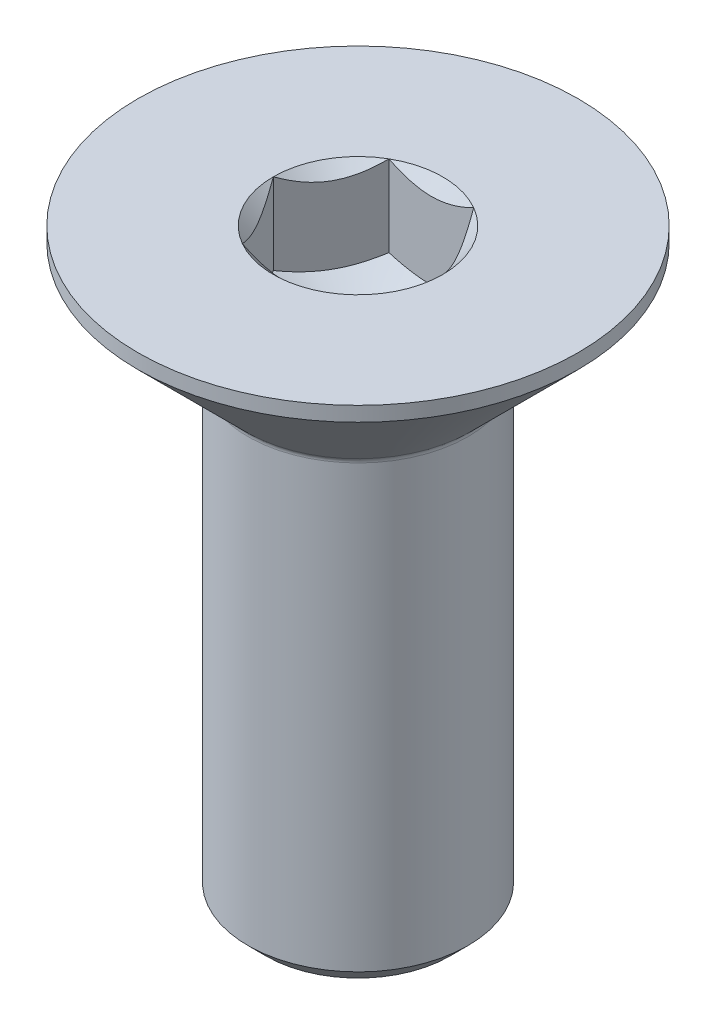
ISO-10303-21;
HEADER;
FILE_DESCRIPTION(('STEP AP214'),'2;1');
FILE_NAME('part.step','',(''),(''),'','','');
FILE_SCHEMA(('AUTOMOTIVE_DESIGN { 1 0 10303 214 1 1 1 1 }'));
ENDSEC;
DATA;
#1=APPLICATION_CONTEXT('core data for automotive mechanical design processes');
#2=APPLICATION_PROTOCOL_DEFINITION('international standard','automotive_design',2000,#1);
#3=PRODUCT_CONTEXT('',#1,'mechanical');
#4=PRODUCT('Part','Part','',(#3));
#5=PRODUCT_RELATED_PRODUCT_CATEGORY('part','',(#4));
#6=PRODUCT_DEFINITION_FORMATION('','',#4);
#7=PRODUCT_DEFINITION_CONTEXT('part definition',#1,'design');
#8=PRODUCT_DEFINITION('design','',#6,#7);
#9=PRODUCT_DEFINITION_SHAPE('','',#8);
#10=(LENGTH_UNIT() NAMED_UNIT(*) SI_UNIT(.MILLI.,.METRE.));
#11=(NAMED_UNIT(*) PLANE_ANGLE_UNIT() SI_UNIT($,.RADIAN.));
#12=(NAMED_UNIT(*) SI_UNIT($,.STERADIAN.) SOLID_ANGLE_UNIT());
#13=UNCERTAINTY_MEASURE_WITH_UNIT(LENGTH_MEASURE(1.E-05),#10,'distance_accuracy_value','');
#14=(GEOMETRIC_REPRESENTATION_CONTEXT(3) GLOBAL_UNCERTAINTY_ASSIGNED_CONTEXT((#13)) GLOBAL_UNIT_ASSIGNED_CONTEXT((#10,
#11,#12)) REPRESENTATION_CONTEXT('',''));
#15=CARTESIAN_POINT('',(0.,0.,0.));
#16=DIRECTION('',(0.,0.,1.));
#17=DIRECTION('',(1.,0.,0.));
#18=AXIS2_PLACEMENT_3D('',#15,#16,#17);
#19=CARTESIAN_POINT('',(1.2500000000036,-8.,0.));
#20=DIRECTION('',(0.,-1.,0.));
#21=DIRECTION('',(1.,0.,0.));
#22=AXIS2_PLACEMENT_3D('',#19,#20,#21);
#23=PLANE('',#22);
#24=CARTESIAN_POINT('',(0.,-8.00000000000001,0.));
#25=DIRECTION('',(0.,-1.,0.));
#26=DIRECTION('',(1.,0.,0.));
#27=AXIS2_PLACEMENT_3D('',#24,#25,#26);
#28=CIRCLE('',#27,1.25000000000357);
#29=CARTESIAN_POINT('',(1.2500000000036,-8.,0.));
#30=VERTEX_POINT('',#29);
#31=EDGE_CURVE('E46',#30,#30,#28,.T.);
#32=ORIENTED_EDGE('',*,*,#31,.T.);
#33=EDGE_LOOP('',(#32));
#34=FACE_BOUND('',#33,.T.);
#35=ADVANCED_FACE('F33',(#34),#23,.T.);
#36=CARTESIAN_POINT('',(0.,-8.00000000000001,0.));
#37=DIRECTION('',(0.,1.,0.));
#38=DIRECTION('',(-1.,0.,0.));
#39=AXIS2_PLACEMENT_3D('',#36,#37,#38);
#40=CONICAL_SURFACE('',#39,1.25000000000357,0.785398163397283);
#41=CARTESIAN_POINT('',(0.,-7.74999999999992,0.));
#42=DIRECTION('',(0.,-1.,0.));
#43=DIRECTION('',(1.,0.,0.));
#44=AXIS2_PLACEMENT_3D('',#41,#42,#43);
#45=CIRCLE('',#44,1.50000000000357);
#46=CARTESIAN_POINT('',(1.5000000000036,-7.74999999999992,0.));
#47=VERTEX_POINT('',#46);
#48=EDGE_CURVE('E236',#47,#47,#45,.T.);
#49=ORIENTED_EDGE('',*,*,#48,.T.);
#50=EDGE_LOOP('',(#49));
#51=FACE_BOUND('',#50,.T.);
#52=ORIENTED_EDGE('',*,*,#31,.F.);
#53=EDGE_LOOP('',(#52));
#54=FACE_BOUND('',#53,.T.);
#55=ADVANCED_FACE('F242',(#51,#54),#40,.T.);
#56=CARTESIAN_POINT('',(3.49148133884313E-12,-1000.,0.));
#57=DIRECTION('',(0.,-1.,0.));
#58=DIRECTION('',(1.,0.,0.));
#59=AXIS2_PLACEMENT_3D('',#56,#57,#58);
#60=CYLINDRICAL_SURFACE('',#59,1.50000000000356);
#61=CARTESIAN_POINT('',(0.,-1.74142135623734,0.));
#62=DIRECTION('',(0.,-1.,0.));
#63=DIRECTION('',(1.,0.,0.));
#64=AXIS2_PLACEMENT_3D('',#61,#62,#63);
#65=CIRCLE('',#64,1.50000000000354);
#66=CARTESIAN_POINT('',(1.50000000000354,-1.74142135623733,0.));
#67=VERTEX_POINT('',#66);
#68=EDGE_CURVE('E233',#67,#67,#65,.T.);
#69=ORIENTED_EDGE('',*,*,#68,.T.);
#70=EDGE_LOOP('',(#69));
#71=FACE_BOUND('',#70,.T.);
#72=ORIENTED_EDGE('',*,*,#48,.F.);
#73=EDGE_LOOP('',(#72));
#74=FACE_BOUND('',#73,.T.);
#75=ADVANCED_FACE('F244',(#71,#74),#60,.T.);
#76=CARTESIAN_POINT('',(0.,-1.74142135623745,0.));
#77=DIRECTION('',(0.,-1.,0.));
#78=DIRECTION('',(1.,0.,0.));
#79=AXIS2_PLACEMENT_3D('',#76,#77,#78);
#80=TOROIDAL_SURFACE('',#79,1.60000000000348,0.0999999999999455);
#81=CARTESIAN_POINT('',(0.,-1.67071067811864,0.));
#82=DIRECTION('',(0.,-1.,0.));
#83=DIRECTION('',(1.,0.,0.));
#84=AXIS2_PLACEMENT_3D('',#81,#82,#83);
#85=CIRCLE('',#84,1.52928932188494);
#86=CARTESIAN_POINT('',(1.52928932188494,-1.67071067811863,0.));
#87=VERTEX_POINT('',#86);
#88=EDGE_CURVE('E230',#87,#87,#85,.T.);
#89=ORIENTED_EDGE('',*,*,#88,.T.);
#90=EDGE_LOOP('',(#89));
#91=FACE_BOUND('',#90,.T.);
#92=ORIENTED_EDGE('',*,*,#68,.F.);
#93=EDGE_LOOP('',(#92));
#94=FACE_BOUND('',#93,.T.);
#95=ADVANCED_FACE('F250',(#91,#94),#80,.F.);
#96=CARTESIAN_POINT('',(0.,-1.67071067811864,0.));
#97=DIRECTION('',(0.,1.,0.));
#98=DIRECTION('',(-1.,0.,0.));
#99=AXIS2_PLACEMENT_3D('',#96,#97,#98);
#100=CONICAL_SURFACE('',#99,1.52928932188494,0.785398163397413);
#101=CARTESIAN_POINT('',(0.,-0.199999999999978,0.));
#102=DIRECTION('',(0.,-1.,0.));
#103=DIRECTION('',(1.,0.,0.));
#104=AXIS2_PLACEMENT_3D('',#101,#102,#103);
#105=CIRCLE('',#104,3.00000000000349);
#106=CARTESIAN_POINT('',(3.00000000000349,-0.199999999999968,0.));
#107=VERTEX_POINT('',#106);
#108=EDGE_CURVE('E227',#107,#107,#105,.T.);
#109=ORIENTED_EDGE('',*,*,#108,.T.);
#110=EDGE_LOOP('',(#109));
#111=FACE_BOUND('',#110,.T.);
#112=ORIENTED_EDGE('',*,*,#88,.F.);
#113=EDGE_LOOP('',(#112));
#114=FACE_BOUND('',#113,.T.);
#115=ADVANCED_FACE('F256',(#111,#114),#100,.T.);
#116=CARTESIAN_POINT('',(3.49148133884313E-12,-1000.,0.));
#117=DIRECTION('',(0.,-1.,0.));
#118=DIRECTION('',(1.,0.,0.));
#119=AXIS2_PLACEMENT_3D('',#116,#117,#118);
#120=CYLINDRICAL_SURFACE('',#119,3.00000000000349);
#121=CARTESIAN_POINT('',(0.,0.,0.));
#122=DIRECTION('',(0.,-1.,0.));
#123=DIRECTION('',(1.,0.,0.));
#124=AXIS2_PLACEMENT_3D('',#121,#122,#123);
#125=CIRCLE('',#124,3.00000000000349);
#126=CARTESIAN_POINT('',(3.00000000000349,0.,0.));
#127=VERTEX_POINT('',#126);
#128=EDGE_CURVE('E224',#127,#127,#125,.T.);
#129=ORIENTED_EDGE('',*,*,#128,.T.);
#130=EDGE_LOOP('',(#129));
#131=FACE_BOUND('',#130,.T.);
#132=ORIENTED_EDGE('',*,*,#108,.F.);
#133=EDGE_LOOP('',(#132));
#134=FACE_BOUND('',#133,.T.);
#135=ADVANCED_FACE('F260',(#131,#134),#120,.T.);
#136=CARTESIAN_POINT('',(1.00000000000349,0.,0.));
#137=DIRECTION('',(0.,1.,0.));
#138=DIRECTION('',(-1.,0.,0.));
#139=AXIS2_PLACEMENT_3D('',#136,#137,#138);
#140=PLANE('',#139);
#141=CARTESIAN_POINT('',(0.,0.,0.));
#142=DIRECTION('',(0.,-1.,0.));
#143=DIRECTION('',(1.,0.,0.));
#144=AXIS2_PLACEMENT_3D('',#141,#142,#143);
#145=CIRCLE('',#144,1.15470053838328);
#146=CARTESIAN_POINT('',(-0.577350269191641,0.,1.00000000000349));
#147=VERTEX_POINT('',#146);
#148=CARTESIAN_POINT('',(-1.15470053838328,0.,0.));
#149=VERTEX_POINT('',#148);
#150=EDGE_CURVE('E104',#147,#149,#145,.T.);
#151=ORIENTED_EDGE('',*,*,#150,.T.);
#152=CARTESIAN_POINT('',(-0.577350269191642,0.,-1.00000000000349));
#153=VERTEX_POINT('',#152);
#154=EDGE_CURVE('E95',#149,#153,#145,.T.);
#155=ORIENTED_EDGE('',*,*,#154,.T.);
#156=CARTESIAN_POINT('',(0.577350269191642,0.,-1.00000000000349));
#157=VERTEX_POINT('',#156);
#158=EDGE_CURVE('E105',#153,#157,#145,.T.);
#159=ORIENTED_EDGE('',*,*,#158,.T.);
#160=CARTESIAN_POINT('',(1.15470053838328,0.,0.));
#161=VERTEX_POINT('',#160);
#162=EDGE_CURVE('E52',#157,#161,#145,.T.);
#163=ORIENTED_EDGE('',*,*,#162,.T.);
#164=CARTESIAN_POINT('',(0.577350269191642,0.,1.00000000000349));
#165=VERTEX_POINT('',#164);
#166=EDGE_CURVE('E59',#161,#165,#145,.T.);
#167=ORIENTED_EDGE('',*,*,#166,.T.);
#168=EDGE_CURVE('E133',#165,#147,#145,.T.);
#169=ORIENTED_EDGE('',*,*,#168,.T.);
#170=EDGE_LOOP('',(#151,#155,#159,#163,#167,#169));
#171=FACE_BOUND('',#170,.T.);
#172=ORIENTED_EDGE('',*,*,#128,.F.);
#173=EDGE_LOOP('',(#172));
#174=FACE_BOUND('',#173,.T.);
#175=ADVANCED_FACE('F131',(#171,#174),#140,.T.);
#176=CARTESIAN_POINT('',(0.,-1.15470053837974,0.));
#177=DIRECTION('',(0.,1.,0.));
#178=DIRECTION('',(-1.,0.,0.));
#179=AXIS2_PLACEMENT_3D('',#176,#177,#178);
#180=CONICAL_SURFACE('',#179,3.48744972346143E-12,0.785398163397473);
#181=ORIENTED_EDGE('',*,*,#150,.F.);
#182=CARTESIAN_POINT('',(-1.15481600843712,0.000115487372609526,-0.000200000000000174));
#183=CARTESIAN_POINT('',(-1.13496520795422,-0.0197220691743403,0.0341825950073019));
#184=CARTESIAN_POINT('',(-1.11478247256331,-0.0383949793612493,0.0691401181400695));
#185=CARTESIAN_POINT('',(-1.07362739529594,-0.0725852572770991,0.140422802956586));
#186=CARTESIAN_POINT('',(-1.05265113558447,-0.0880835909768522,0.176754750529609));
#187=CARTESIAN_POINT('',(-1.01035337910155,-0.114632692858137,0.250016613804194));
#188=CARTESIAN_POINT('',(-0.989042666112687,-0.125750226003514,0.286927851446427));
#189=CARTESIAN_POINT('',(-0.945952199285986,-0.142880134224317,0.361562729312135));
#190=CARTESIAN_POINT('',(-0.924173762629814,-0.148905302533846,0.399284088110045));
#191=CARTESIAN_POINT('',(-0.886641312643099,-0.154339445033042,0.464292198419572));
#192=CARTESIAN_POINT('',(-0.870936130675305,-0.155143061683806,0.491494371529908));
#193=CARTESIAN_POINT('',(-0.839556179865766,-0.153793300583645,0.545846040671041));
#194=CARTESIAN_POINT('',(-0.823881418497786,-0.151639270453324,0.572995523756901));
#195=CARTESIAN_POINT('',(-0.777080970602062,-0.140883027872012,0.654056277329273));
#196=CARTESIAN_POINT('',(-0.746188191119016,-0.12798544358508,0.70756414098093));
#197=CARTESIAN_POINT('',(-0.691968116422048,-0.0968592693981482,0.801476065146259));
#198=CARTESIAN_POINT('',(-0.668386557295692,-0.0802622022984302,0.842320523674798));
#199=CARTESIAN_POINT('',(-0.622147085935847,-0.0428750753148519,0.922409637385175));
#200=CARTESIAN_POINT('',(-0.599486449586665,-0.0220986581826724,0.961659010873801));
#201=CARTESIAN_POINT('',(-0.577234799137803,0.00011548737261181,1.00020000000349));
#202=B_SPLINE_CURVE_WITH_KNOTS('',3,(#182,#183,#184,#185,#186,#187,#188,#189,#190,#191,#192,
#193,#194,#195,#196,#197,#198,#199,#200,#201),.UNSPECIFIED.,.F.,.F.,(4,2,2,2,2,2,2,2,2,4),(0.,
0.133237676829028,0.267252229835431,0.399137076270705,0.530689603282637,0.624814864266049,
0.718960890151671,0.907306626115304,1.0571010036216,1.20641411519707),.UNSPECIFIED.);
#203=EDGE_CURVE('E11',#149,#147,#202,.T.);
#204=ORIENTED_EDGE('',*,*,#203,.F.);
#205=EDGE_LOOP('',(#181,#204));
#206=FACE_BOUND('',#205,.T.);
#207=ADVANCED_FACE('F109',(#206),#180,.F.);
#208=ORIENTED_EDGE('',*,*,#168,.F.);
#209=CARTESIAN_POINT('',(-1.15147208663654,0.370385677641903,1.00000000000349));
#210=CARTESIAN_POINT('',(-1.12343448005264,0.3492199199968,1.00000000000349));
#211=CARTESIAN_POINT('',(-1.09524064866927,0.328261692294052,1.00000000000349));
#212=CARTESIAN_POINT('',(-1.03847715659637,0.286846022343904,1.00000000000349));
#213=CARTESIAN_POINT('',(-1.00990740397748,0.266388706227025,1.00000000000349));
#214=CARTESIAN_POINT('',(-0.923120894466306,0.20560479504304,1.00000000000349));
#215=CARTESIAN_POINT('',(-0.864253173881754,0.166192229040082,1.00000000000349));
#216=CARTESIAN_POINT('',(-0.740809858358654,0.0888206642586485,1.00000000000349));
#217=CARTESIAN_POINT('',(-0.676100255226406,0.0510730391624645,1.00000000000349));
#218=CARTESIAN_POINT('',(-0.543448939112691,-0.0179754124197183,1.00000000000349));
#219=CARTESIAN_POINT('',(-0.475519112078331,-0.0492979721329686,1.00000000000349));
#220=CARTESIAN_POINT('',(-0.373555850374099,-0.0876182211026492,1.00000000000349));
#221=CARTESIAN_POINT('',(-0.341031989715377,-0.0986164083440795,1.00000000000349));
#222=CARTESIAN_POINT('',(-0.275199079104689,-0.118001657839264,1.00000000000349));
#223=CARTESIAN_POINT('',(-0.241889975230356,-0.12638854021052,1.00000000000349));
#224=CARTESIAN_POINT('',(-0.175247517107332,-0.139974779270324,1.00000000000349));
#225=CARTESIAN_POINT('',(-0.141925568286401,-0.145229209222874,1.00000000000349));
#226=CARTESIAN_POINT('',(-0.0749144363081457,-0.152451313423844,1.00000000000349));
#227=CARTESIAN_POINT('',(-0.0412251979297822,-0.154418486386623,1.00000000000349));
#228=CARTESIAN_POINT('',(0.0249580991768892,-0.154916801609423,1.00000000000349));
#229=CARTESIAN_POINT('',(0.0574512825563398,-0.153569732116963,1.00000000000349));
#230=CARTESIAN_POINT('',(0.12214850560616,-0.147783515513095,1.00000000000349));
#231=CARTESIAN_POINT('',(0.15435261003438,-0.143345079354014,1.00000000000349));
#232=CARTESIAN_POINT('',(0.218799898763491,-0.131543169877609,1.00000000000349));
#233=CARTESIAN_POINT('',(0.251033743162051,-0.124129458988119,1.00000000000349));
#234=CARTESIAN_POINT('',(0.314797132242783,-0.106771057535658,1.00000000000349));
#235=CARTESIAN_POINT('',(0.346326735616389,-0.0968265787493942,1.00000000000349));
#236=CARTESIAN_POINT('',(0.445594187590724,-0.0617765175022711,1.00000000000349));
#237=CARTESIAN_POINT('',(0.51191913931543,-0.0326791417168095,1.00000000000349));
#238=CARTESIAN_POINT('',(0.641453244456302,0.032015329577265,1.00000000000349));
#239=CARTESIAN_POINT('',(0.704650132905627,0.0676357765872091,1.00000000000349));
#240=CARTESIAN_POINT('',(0.825428489919259,0.141123901182951,1.00000000000349));
#241=CARTESIAN_POINT('',(0.883132947596308,0.178791946954486,1.00000000000349));
#242=CARTESIAN_POINT('',(0.968148853410049,0.23702285273679,1.00000000000349));
#243=CARTESIAN_POINT('',(0.996120570078167,0.256638475548086,1.00000000000349));
#244=CARTESIAN_POINT('',(1.05168177698174,0.29638851682972,1.00000000000349));
#245=CARTESIAN_POINT('',(1.07927136965218,0.316522791958896,1.00000000000349));
#246=CARTESIAN_POINT('',(1.10670185313093,0.336872118824662,1.00000000000349));
#247=B_SPLINE_CURVE_WITH_KNOTS('',3,(#209,#210,#211,#212,#213,#214,#215,#216,#217,#218,#219,
#220,#221,#222,#223,#224,#225,#226,#227,#228,#229,#230,#231,#232,#233,#234,#235,#236,#237,#238,
#239,#240,#241,#242,#243,#244,#245,#246),.UNSPECIFIED.,.F.,.F.,(4,2,2,2,2,2,2,2,2,2,2,2,2,2,2,2,
2,2,4),(0.,0.105386459103751,0.210799187371051,0.423233611648083,0.647793541037823,
0.871580877914197,0.974493074345769,1.07741235842514,1.17846428217443,1.27953161428925,
1.3769408675179,1.47432772596603,1.57343322814428,1.67253043981925,1.88917353998091,
2.10660791032216,2.31323734236527,2.41572589215415,2.5181864145656),.UNSPECIFIED.);
#248=EDGE_CURVE('E135',#147,#165,#247,.T.);
#249=ORIENTED_EDGE('',*,*,#248,.F.);
#250=EDGE_LOOP('',(#208,#249));
#251=FACE_BOUND('',#250,.T.);
#252=ADVANCED_FACE('F268',(#251),#180,.F.);
#253=ORIENTED_EDGE('',*,*,#166,.F.);
#254=CARTESIAN_POINT('',(0.577234799137804,0.000115487372616001,1.00020000000349));
#255=CARTESIAN_POINT('',(0.597085599620708,-0.0197220691743342,0.96581740499619));
#256=CARTESIAN_POINT('',(0.617268335011614,-0.0383949793612432,0.930859881863422));
#257=CARTESIAN_POINT('',(0.658423412278989,-0.0725852572770927,0.859577197046906));
#258=CARTESIAN_POINT('',(0.679399671990457,-0.0880835909768455,0.823245249473883));
#259=CARTESIAN_POINT('',(0.721697428473373,-0.114632692858131,0.749983386199297));
#260=CARTESIAN_POINT('',(0.743008141462238,-0.125750226003508,0.713072148557064));
#261=CARTESIAN_POINT('',(0.78609860828894,-0.142880134224311,0.638437270691356));
#262=CARTESIAN_POINT('',(0.807877044945111,-0.14890530253384,0.600715911893447));
#263=CARTESIAN_POINT('',(0.845409494931826,-0.154339445033036,0.535707801583919));
#264=CARTESIAN_POINT('',(0.861114676899621,-0.1551430616838,0.508505628473584));
#265=CARTESIAN_POINT('',(0.892494627709159,-0.153793300583639,0.454153959332451));
#266=CARTESIAN_POINT('',(0.90816938907714,-0.151639270453318,0.427004476246591));
#267=CARTESIAN_POINT('',(0.954969836972863,-0.140883027872005,0.345943722674218));
#268=CARTESIAN_POINT('',(0.985862616455909,-0.127985443585073,0.292435859022561));
#269=CARTESIAN_POINT('',(1.04008269115288,-0.0968592693981418,0.198523934857233));
#270=CARTESIAN_POINT('',(1.06366425027923,-0.0802622022984239,0.157679476328694));
#271=CARTESIAN_POINT('',(1.10990372163908,-0.0428750753148458,0.0775903626183164));
#272=CARTESIAN_POINT('',(1.13256435798826,-0.0220986581826663,0.038340989129691));
#273=CARTESIAN_POINT('',(1.15481600843712,0.000115487372617978,-0.000200000000000404));
#274=B_SPLINE_CURVE_WITH_KNOTS('',3,(#254,#255,#256,#257,#258,#259,#260,#261,#262,#263,#264,
#265,#266,#267,#268,#269,#270,#271,#272,#273),.UNSPECIFIED.,.F.,.F.,(4,2,2,2,2,2,2,2,2,4),(0.,
0.133237676829028,0.267252229835432,0.399137076270706,0.530689603282637,0.62481486426605,
0.718960890151671,0.907306626115305,1.0571010036216,1.20641411519707),.UNSPECIFIED.);
#275=EDGE_CURVE('E143',#165,#161,#274,.T.);
#276=ORIENTED_EDGE('',*,*,#275,.F.);
#277=EDGE_LOOP('',(#253,#276));
#278=FACE_BOUND('',#277,.T.);
#279=ADVANCED_FACE('F272',(#278),#180,.F.);
#280=ORIENTED_EDGE('',*,*,#162,.F.);
#281=CARTESIAN_POINT('',(1.15481600843712,0.000115487372618014,0.000199999999999658));
#282=CARTESIAN_POINT('',(1.13496520795422,-0.019722069174332,-0.0341825950073024));
#283=CARTESIAN_POINT('',(1.11478247256331,-0.0383949793612412,-0.0691401181400699));
#284=CARTESIAN_POINT('',(1.07362739529594,-0.0725852572770912,-0.140422802956586));
#285=CARTESIAN_POINT('',(1.05265113558447,-0.0880835909768443,-0.176754750529609));
#286=CARTESIAN_POINT('',(1.01035337910155,-0.114632692858129,-0.250016613804194));
#287=CARTESIAN_POINT('',(0.989042666112689,-0.125750226003507,-0.286927851446428));
#288=CARTESIAN_POINT('',(0.945952199285987,-0.14288013422431,-0.361562729312135));
#289=CARTESIAN_POINT('',(0.924173762629816,-0.148905302533839,-0.399284088110045));
#290=CARTESIAN_POINT('',(0.886641312643101,-0.154339445033036,-0.464292198419572));
#291=CARTESIAN_POINT('',(0.870936130675306,-0.1551430616838,-0.491494371529908));
#292=CARTESIAN_POINT('',(0.839556179865768,-0.153793300583638,-0.545846040671041));
#293=CARTESIAN_POINT('',(0.823881418497787,-0.151639270453318,-0.572995523756901));
#294=CARTESIAN_POINT('',(0.777080970602064,-0.140883027872006,-0.654056277329273));
#295=CARTESIAN_POINT('',(0.746188191119018,-0.127985443585074,-0.70756414098093));
#296=CARTESIAN_POINT('',(0.69196811642205,-0.0968592693981428,-0.801476065146259));
#297=CARTESIAN_POINT('',(0.668386557295693,-0.0802622022984252,-0.842320523674798));
#298=CARTESIAN_POINT('',(0.622147085935848,-0.0428750753148475,-0.922409637385175));
#299=CARTESIAN_POINT('',(0.599486449586666,-0.0220986581826684,-0.9616590108738));
#300=CARTESIAN_POINT('',(0.577234799137804,0.000115487372615756,-1.00020000000349));
#301=B_SPLINE_CURVE_WITH_KNOTS('',3,(#281,#282,#283,#284,#285,#286,#287,#288,#289,#290,#291,
#292,#293,#294,#295,#296,#297,#298,#299,#300),.UNSPECIFIED.,.F.,.F.,(4,2,2,2,2,2,2,2,2,4),(0.,
0.133237676829028,0.267252229835431,0.399137076270705,0.530689603282636,0.624814864266049,
0.71896089015167,0.907306626115304,1.0571010036216,1.20641411519707),.UNSPECIFIED.);
#302=EDGE_CURVE('E165',#161,#157,#301,.T.);
#303=ORIENTED_EDGE('',*,*,#302,.F.);
#304=EDGE_LOOP('',(#280,#303));
#305=FACE_BOUND('',#304,.T.);
#306=ADVANCED_FACE('F277',(#305),#180,.F.);
#307=ORIENTED_EDGE('',*,*,#158,.F.);
#308=CARTESIAN_POINT('',(-1.15147208646964,0.370385677515887,-1.00000000000349));
#309=CARTESIAN_POINT('',(-1.12343447989042,0.349219919875641,-1.00000000000349));
#310=CARTESIAN_POINT('',(-1.09524064851176,0.328261692177744,-1.00000000000349));
#311=CARTESIAN_POINT('',(-1.03847715644831,0.286846022237266,-1.00000000000349));
#312=CARTESIAN_POINT('',(-1.00990740383417,0.26638870612521,-1.00000000000349));
#313=CARTESIAN_POINT('',(-0.923120894337536,0.20560479495578,-1.00000000000349));
#314=CARTESIAN_POINT('',(-0.864253173762872,0.166192228962486,-1.00000000000349));
#315=CARTESIAN_POINT('',(-0.740809858261334,0.088820664200925,-1.00000000000349));
#316=CARTESIAN_POINT('',(-0.676100255140819,0.0510730391148783,-1.00000000000349));
#317=CARTESIAN_POINT('',(-0.543448939051566,-0.0179754124485145,-1.00000000000349));
#318=CARTESIAN_POINT('',(-0.475519112029928,-0.0492979721530993,-1.00000000000349));
#319=CARTESIAN_POINT('',(-0.373555850335248,-0.0876182211163642,-1.00000000000349));
#320=CARTESIAN_POINT('',(-0.341031989672497,-0.0986164083580571,-1.00000000000349));
#321=CARTESIAN_POINT('',(-0.27519907905362,-0.118001657852951,-1.00000000000349));
#322=CARTESIAN_POINT('',(-0.241889975175126,-0.126388540223656,-1.00000000000349));
#323=CARTESIAN_POINT('',(-0.175247517043918,-0.139974779281413,-1.00000000000349));
#324=CARTESIAN_POINT('',(-0.141925568218967,-0.145229209232493,-1.00000000000349));
#325=CARTESIAN_POINT('',(-0.074914436232801,-0.152451313429615,-1.00000000000349));
#326=CARTESIAN_POINT('',(-0.0412251978505476,-0.154418486390016,-1.00000000000349));
#327=CARTESIAN_POINT('',(0.0249580992632989,-0.154916801607379,-1.00000000000349));
#328=CARTESIAN_POINT('',(0.0574512826460447,-0.153569732111907,-1.00000000000349));
#329=CARTESIAN_POINT('',(0.122148505702126,-0.147783515501546,-1.00000000000349));
#330=CARTESIAN_POINT('',(0.154352610133313,-0.143345079338983,-1.00000000000349));
#331=CARTESIAN_POINT('',(0.21879989886828,-0.131543169855276,-1.00000000000349));
#332=CARTESIAN_POINT('',(0.251033743269721,-0.124129458961945,-1.00000000000349));
#333=CARTESIAN_POINT('',(0.314797132355939,-0.106771057501716,-1.00000000000349));
#334=CARTESIAN_POINT('',(0.346326735732149,-0.0968265787115251,-1.00000000000349));
#335=CARTESIAN_POINT('',(0.445594187731703,-0.061776517445899,-1.00000000000349));
#336=CARTESIAN_POINT('',(0.511919139477759,-0.0326791416434166,-1.00000000000349));
#337=CARTESIAN_POINT('',(0.641453244659694,0.0320153296865747,-1.00000000000349));
#338=CARTESIAN_POINT('',(0.704650133128721,0.0676357767154281,-1.00000000000349));
#339=CARTESIAN_POINT('',(0.825428490177774,0.141123901347363,-1.00000000000349));
#340=CARTESIAN_POINT('',(0.883132947870669,0.178791947136016,-1.00000000000349));
#341=CARTESIAN_POINT('',(0.968148853707839,0.237022852943908,-1.00000000000349));
#342=CARTESIAN_POINT('',(0.996120570383654,0.256638475763666,-1.00000000000349));
#343=CARTESIAN_POINT('',(1.05168177730257,0.296388517062212,-1.00000000000349));
#344=CARTESIAN_POINT('',(1.07927136998065,0.31652279219984,-1.00000000000349));
#345=CARTESIAN_POINT('',(1.10670185346704,0.336872119074047,-1.00000000000349));
#346=B_SPLINE_CURVE_WITH_KNOTS('',3,(#308,#309,#310,#311,#312,#313,#314,#315,#316,#317,#318,
#319,#320,#321,#322,#323,#324,#325,#326,#327,#328,#329,#330,#331,#332,#333,#334,#335,#336,#337,
#338,#339,#340,#341,#342,#343,#344,#345),.UNSPECIFIED.,.F.,.F.,(4,2,2,2,2,2,2,2,2,2,2,2,2,2,2,2,
2,2,4),(0.,0.105386459083748,0.210799187331038,0.423233611567304,0.647793540911335,
0.871580877742434,0.974493074185665,1.07741235827668,1.17846428203712,1.27953161416311,
1.37694086740197,1.47432772586032,1.57343322804957,1.67253043973554,1.88917353997603,
2.10660791039662,2.31323734250762,2.41572589232997,2.51818641477491),.UNSPECIFIED.);
#347=EDGE_CURVE('E122',#157,#153,#346,.F.);
#348=ORIENTED_EDGE('',*,*,#347,.F.);
#349=EDGE_LOOP('',(#307,#348));
#350=FACE_BOUND('',#349,.T.);
#351=ADVANCED_FACE('F156',(#350),#180,.F.);
#352=ORIENTED_EDGE('',*,*,#154,.F.);
#353=CARTESIAN_POINT('',(-0.577234799137804,0.000115487372611613,-1.00020000000349));
#354=CARTESIAN_POINT('',(-0.597085599620708,-0.0197220691743386,-0.96581740499619));
#355=CARTESIAN_POINT('',(-0.617268335011613,-0.0383949793612478,-0.930859881863422));
#356=CARTESIAN_POINT('',(-0.658423412278988,-0.0725852572770976,-0.859577197046906));
#357=CARTESIAN_POINT('',(-0.679399671990456,-0.0880835909768506,-0.823245249473883));
#358=CARTESIAN_POINT('',(-0.721697428473372,-0.114632692858136,-0.749983386199297));
#359=CARTESIAN_POINT('',(-0.743008141462237,-0.125750226003514,-0.713072148557064));
#360=CARTESIAN_POINT('',(-0.786098608288939,-0.142880134224316,-0.638437270691356));
#361=CARTESIAN_POINT('',(-0.80787704494511,-0.148905302533845,-0.600715911893447));
#362=CARTESIAN_POINT('',(-0.845409494931825,-0.154339445033042,-0.535707801583919));
#363=CARTESIAN_POINT('',(-0.861114676899619,-0.155143061683806,-0.508505628473584));
#364=CARTESIAN_POINT('',(-0.892494627709158,-0.153793300583645,-0.454153959332451));
#365=CARTESIAN_POINT('',(-0.908169389077139,-0.151639270453324,-0.427004476246591));
#366=CARTESIAN_POINT('',(-0.954969836972862,-0.140883027872012,-0.345943722674219));
#367=CARTESIAN_POINT('',(-0.985862616455908,-0.12798544358508,-0.292435859022562));
#368=CARTESIAN_POINT('',(-1.04008269115288,-0.0968592693981492,-0.198523934857233));
#369=CARTESIAN_POINT('',(-1.06366425027923,-0.0802622022984315,-0.157679476328694));
#370=CARTESIAN_POINT('',(-1.10990372163908,-0.0428750753148539,-0.077590362618317));
#371=CARTESIAN_POINT('',(-1.13256435798826,-0.0220986581826747,-0.0383409891296915));
#372=CARTESIAN_POINT('',(-1.15481600843712,0.000115487372609258,0.000199999999999825));
#373=B_SPLINE_CURVE_WITH_KNOTS('',3,(#353,#354,#355,#356,#357,#358,#359,#360,#361,#362,#363,
#364,#365,#366,#367,#368,#369,#370,#371,#372),.UNSPECIFIED.,.F.,.F.,(4,2,2,2,2,2,2,2,2,4),(0.,
0.133237676829028,0.267252229835431,0.399137076270705,0.530689603282637,0.624814864266049,
0.71896089015167,0.907306626115304,1.0571010036216,1.20641411519707),.UNSPECIFIED.);
#374=EDGE_CURVE('E99',#153,#149,#373,.T.);
#375=ORIENTED_EDGE('',*,*,#374,.F.);
#376=EDGE_LOOP('',(#352,#375));
#377=FACE_BOUND('',#376,.T.);
#378=ADVANCED_FACE('F97',(#377),#180,.F.);
#379=CARTESIAN_POINT('',(0.,-1.19999999999998,0.));
#380=DIRECTION('',(0.,1.,0.));
#381=DIRECTION('',(-1.,0.,0.));
#382=AXIS2_PLACEMENT_3D('',#379,#380,#381);
#383=CONICAL_SURFACE('',#382,1.00000000000349,1.02974425867668);
#384=CARTESIAN_POINT('',(3.49148133884313E-12,-1.80086061902751,0.));
#385=VERTEX_POINT('',#384);
#386=VERTEX_LOOP('',#385);
#387=FACE_BOUND('',#386,.T.);
#388=CARTESIAN_POINT('',(-1.15481600843712,-1.10697714693101,0.000199999999999798));
#389=CARTESIAN_POINT('',(-1.12935116507995,-1.12228656434843,-0.0439064025013927));
#390=CARTESIAN_POINT('',(-1.10364823852631,-1.13621685779916,-0.0884251771955121));
#391=CARTESIAN_POINT('',(-1.05175857468757,-1.16052679031257,-0.178300711351871));
#392=CARTESIAN_POINT('',(-1.02557073498061,-1.1708969137401,-0.223659380264804));
#393=CARTESIAN_POINT('',(-0.973546893090511,-1.18698528267293,-0.313767317623385));
#394=CARTESIAN_POINT('',(-0.947720309197346,-1.19282089958546,-0.358500273112287));
#395=CARTESIAN_POINT('',(-0.895938231074251,-1.1997177748972,-0.448189463342988));
#396=CARTESIAN_POINT('',(-0.86998296018606,-1.20078552171808,-0.493145311245548));
#397=CARTESIAN_POINT('',(-0.821705437323268,-1.19824333135137,-0.576764433707472));
#398=CARTESIAN_POINT('',(-0.799374231871098,-1.1952562256898,-0.61544321614489));
#399=CARTESIAN_POINT('',(-0.754870072440118,-1.18589528988941,-0.692526681427494));
#400=CARTESIAN_POINT('',(-0.732697301386873,-1.17951803702822,-0.730931047436307));
#401=CARTESIAN_POINT('',(-0.688096323419404,-1.16361562025812,-0.808182207343223));
#402=CARTESIAN_POINT('',(-0.665674665854211,-1.15401890306917,-0.847017657436048));
#403=CARTESIAN_POINT('',(-0.621191001098064,-1.13227595550151,-0.924065624900555));
#404=CARTESIAN_POINT('',(-0.599128326100018,-1.12013523326064,-0.962279298948052));
#405=CARTESIAN_POINT('',(-0.5772347991378,-1.10697714693101,-1.00020000000349));
#406=B_SPLINE_CURVE_WITH_KNOTS('',3,(#388,#389,#390,#391,#392,#393,#394,#395,#396,#397,#398,
#399,#400,#401,#402,#403,#404,#405),.UNSPECIFIED.,.F.,.F.,(4,2,2,2,2,2,2,2,4),(0.,
0.159613304541985,0.319649961982519,0.475391802514061,0.630921634897617,0.765071895664672,
0.899357853656589,1.03685140198062,1.1740502772885),.UNSPECIFIED.);
#407=CARTESIAN_POINT('',(-1.15470053838328,-1.10704653874521,0.));
#408=VERTEX_POINT('',#407);
#409=CARTESIAN_POINT('',(-0.577350269192025,-1.10704653874545,-1.00000000000349));
#410=VERTEX_POINT('',#409);
#411=EDGE_CURVE('E195',#408,#410,#406,.T.);
#412=ORIENTED_EDGE('',*,*,#411,.F.);
#413=CARTESIAN_POINT('',(-0.577234799137799,-1.10697714693101,1.00020000000349));
#414=CARTESIAN_POINT('',(-0.602699642494964,-1.12228656434843,0.9560935975021));
#415=CARTESIAN_POINT('',(-0.628402569048606,-1.13621685779916,0.91157482280798));
#416=CARTESIAN_POINT('',(-0.680292232887342,-1.16052679031257,0.821699288651621));
#417=CARTESIAN_POINT('',(-0.706480072594307,-1.1708969137401,0.776340619738688));
#418=CARTESIAN_POINT('',(-0.758503914484405,-1.18698528267293,0.686232682380107));
#419=CARTESIAN_POINT('',(-0.78433049837757,-1.19282089958546,0.641499726891206));
#420=CARTESIAN_POINT('',(-0.836112576500665,-1.1997177748972,0.551810536660505));
#421=CARTESIAN_POINT('',(-0.862067847388856,-1.20078552171808,0.506854688757944));
#422=CARTESIAN_POINT('',(-0.910345370251648,-1.19824333135137,0.42323556629602));
#423=CARTESIAN_POINT('',(-0.932676575703818,-1.1952562256898,0.384556783858602));
#424=CARTESIAN_POINT('',(-0.977180735134799,-1.18589528988941,0.307473318575998));
#425=CARTESIAN_POINT('',(-0.999353506188044,-1.17951803702822,0.269068952567186));
#426=CARTESIAN_POINT('',(-1.04395448415551,-1.16361562025812,0.191817792660269));
#427=CARTESIAN_POINT('',(-1.06637614172071,-1.15401890306918,0.152982342567444));
#428=CARTESIAN_POINT('',(-1.11085980647685,-1.13227595550151,0.0759343751029364));
#429=CARTESIAN_POINT('',(-1.1329224814749,-1.12013523326065,0.0377207010554399));
#430=CARTESIAN_POINT('',(-1.15481600843712,-1.10697714693101,-0.000200000000000177));
#431=B_SPLINE_CURVE_WITH_KNOTS('',3,(#413,#414,#415,#416,#417,#418,#419,#420,#421,#422,#423,
#424,#425,#426,#427,#428,#429,#430),.UNSPECIFIED.,.F.,.F.,(4,2,2,2,2,2,2,2,4),(0.,
0.159613304541985,0.319649961982519,0.475391802514061,0.630921634897617,0.765071895664672,
0.89935785365659,1.03685140198062,1.1740502772885),.UNSPECIFIED.);
#432=CARTESIAN_POINT('',(-0.577350269191637,-1.1070465387452,1.00000000000349));
#433=VERTEX_POINT('',#432);
#434=EDGE_CURVE('E126',#433,#408,#431,.T.);
#435=ORIENTED_EDGE('',*,*,#434,.F.);
#436=CARTESIAN_POINT('',(-1.53913408251161,-0.698001662483412,1.00000000000349));
#437=CARTESIAN_POINT('',(-1.49569044289415,-0.719887062899432,1.00000000000349));
#438=CARTESIAN_POINT('',(-1.45214002445216,-0.741559486514906,1.00000000000349));
#439=CARTESIAN_POINT('',(-1.36476716015196,-0.784367353950528,1.00000000000349));
#440=CARTESIAN_POINT('',(-1.32094466922916,-0.805502705691535,1.00000000000349));
#441=CARTESIAN_POINT('',(-1.18848406699947,-0.868171247222023,1.00000000000349));
#442=CARTESIAN_POINT('',(-1.09936487241704,-0.908705596087743,1.00000000000349));
#443=CARTESIAN_POINT('',(-0.916403913232966,-0.986812920310714,1.00000000000349));
#444=CARTESIAN_POINT('',(-0.822502575793545,-1.02424801355249,1.00000000000349));
#445=CARTESIAN_POINT('',(-0.632122913748193,-1.09151986121001,1.00000000000349));
#446=CARTESIAN_POINT('',(-0.535651852445618,-1.12137594507495,1.00000000000349));
#447=CARTESIAN_POINT('',(-0.388885984512153,-1.15671862317682,1.00000000000349));
#448=CARTESIAN_POINT('',(-0.339740277476053,-1.16691280126847,1.00000000000349));
#449=CARTESIAN_POINT('',(-0.240798974291492,-1.18348452175653,1.00000000000349));
#450=CARTESIAN_POINT('',(-0.191003471509826,-1.1898626064357,1.00000000000349));
#451=CARTESIAN_POINT('',(-0.091726356555656,-1.19818926009672,1.00000000000349));
#452=CARTESIAN_POINT('',(-0.042249920882395,-1.20019784244902,1.00000000000349));
#453=CARTESIAN_POINT('',(0.056685553881784,-1.19977085509005,1.00000000000349));
#454=CARTESIAN_POINT('',(0.106144590963713,-1.19733487822265,1.00000000000349));
#455=CARTESIAN_POINT('',(0.221889008974768,-1.18665058066376,1.00000000000349));
#456=CARTESIAN_POINT('',(0.288013758338269,-1.17666839983213,1.00000000000349));
#457=CARTESIAN_POINT('',(0.419027781279274,-1.15044805906369,1.00000000000349));
#458=CARTESIAN_POINT('',(0.483915648188271,-1.13420317590698,1.00000000000349));
#459=CARTESIAN_POINT('',(0.581035243500194,-1.10615261141406,1.00000000000349));
#460=CARTESIAN_POINT('',(0.613775266307136,-1.09604000305165,1.00000000000349));
#461=CARTESIAN_POINT('',(0.67890361814048,-1.07479771921291,1.00000000000349));
#462=CARTESIAN_POINT('',(0.711292141526231,-1.06366864160036,1.00000000000349));
#463=CARTESIAN_POINT('',(0.775758808779359,-1.04055645701247,1.00000000000349));
#464=CARTESIAN_POINT('',(0.807836969626201,-1.02857339706071,1.00000000000349));
#465=CARTESIAN_POINT('',(0.871719268500453,-1.00388795379273,1.00000000000349));
#466=CARTESIAN_POINT('',(0.903523368858395,-0.991185473353786,1.00000000000349));
#467=CARTESIAN_POINT('',(1.01047215756527,-0.947296810544312,1.00000000000349));
#468=CARTESIAN_POINT('',(1.08504747385592,-0.91472348778986,1.00000000000349));
#469=CARTESIAN_POINT('',(1.23317880508369,-0.84732648518695,1.00000000000349));
#470=CARTESIAN_POINT('',(1.30673457758917,-0.812502280895382,1.00000000000349));
#471=CARTESIAN_POINT('',(1.45312862641841,-0.741276090941788,1.00000000000349));
#472=CARTESIAN_POINT('',(1.52596645725708,-0.70487319309139,1.00000000000349));
#473=CARTESIAN_POINT('',(1.67107527058815,-0.630952076730746,1.00000000000349));
#474=CARTESIAN_POINT('',(1.74334622748326,-0.593433808218021,1.00000000000349));
#475=CARTESIAN_POINT('',(1.9598765114571,-0.479486133537541,1.00000000000349));
#476=CARTESIAN_POINT('',(2.10349532286462,-0.401842112901531,1.00000000000349));
#477=CARTESIAN_POINT('',(2.38965872704804,-0.244742187067114,1.00000000000349));
#478=CARTESIAN_POINT('',(2.53220370725084,-0.165286981523699,1.00000000000349));
#479=CARTESIAN_POINT('',(2.7955039205652,-0.0170985537286969,1.00000000000349));
#480=CARTESIAN_POINT('',(2.91634985431778,0.0514736897252148,1.00000000000349));
#481=CARTESIAN_POINT('',(3.15771321006817,0.189224971732242,1.00000000000349));
#482=CARTESIAN_POINT('',(3.27823059285003,0.258404078892694,1.00000000000349));
#483=CARTESIAN_POINT('',(3.51847024487779,0.396883853340254,1.00000000000349));
#484=CARTESIAN_POINT('',(3.63819364610531,0.466182558546636,1.00000000000349));
#485=CARTESIAN_POINT('',(3.87743328749257,0.605102006593677,1.00000000000349));
#486=CARTESIAN_POINT('',(3.99694955193056,0.67472270761025,1.00000000000349));
#487=CARTESIAN_POINT('',(4.11639819157838,0.744458585378948,1.00000000000349));
#488=B_SPLINE_CURVE_WITH_KNOTS('',3,(#436,#437,#438,#439,#440,#441,#442,#443,#444,#445,#446,
#447,#448,#449,#450,#451,#452,#453,#454,#455,#456,#457,#458,#459,#460,#461,#462,#463,#464,#465,
#466,#467,#468,#469,#470,#471,#472,#473,#474,#475,#476,#477,#478,#479,#480,#481,#482,#483,#484,
#485,#486,#487),.UNSPECIFIED.,.F.,.F.,(4,2,2,2,2,2,2,2,2,2,2,2,2,2,2,2,2,2,2,2,2,2,2,2,2,4),(0.,
0.145932215583203,0.291889284209803,0.585527571197536,0.888647252427374,1.19098591155706,
1.34144036029909,1.4918734237569,1.64022694948246,1.78859406622513,1.98881553203918,
2.1892525435282,2.29203832796487,2.3947640407863,2.49748410149503,2.6002180627549,
2.84428814305948,3.088415296794,3.33268544026188,3.57696655101335,4.06672802187125,
4.55630340246385,4.97313780008301,5.39001994519612,5.80501818929378,6.21996396374597),.UNSPECIFIED.);
#489=CARTESIAN_POINT('',(0.577350269191646,-1.1070465387452,1.00000000000349));
#490=VERTEX_POINT('',#489);
#491=EDGE_CURVE('E181',#490,#433,#488,.F.);
#492=ORIENTED_EDGE('',*,*,#491,.F.);
#493=CARTESIAN_POINT('',(1.15481600843713,-1.106977146931,-0.000200000000000352));
#494=CARTESIAN_POINT('',(1.12935116507996,-1.12228656434842,0.0439064025013921));
#495=CARTESIAN_POINT('',(1.10364823852632,-1.13621685779916,0.0884251771955114));
#496=CARTESIAN_POINT('',(1.05175857468758,-1.16052679031257,0.178300711351871));
#497=CARTESIAN_POINT('',(1.02557073498062,-1.17089691374009,0.223659380264804));
#498=CARTESIAN_POINT('',(0.97354689309052,-1.18698528267292,0.313767317623385));
#499=CARTESIAN_POINT('',(0.947720309197355,-1.19282089958546,0.358500273112286));
#500=CARTESIAN_POINT('',(0.89593823107426,-1.1997177748972,0.448189463342987));
#501=CARTESIAN_POINT('',(0.869982960186069,-1.20078552171808,0.493145311245548));
#502=CARTESIAN_POINT('',(0.821705437323277,-1.19824333135136,0.576764433707472));
#503=CARTESIAN_POINT('',(0.799374231871107,-1.1952562256898,0.61544321614489));
#504=CARTESIAN_POINT('',(0.754870072440126,-1.1858952898894,0.692526681427494));
#505=CARTESIAN_POINT('',(0.732697301386881,-1.17951803702821,0.730931047436306));
#506=CARTESIAN_POINT('',(0.688096323419412,-1.16361562025812,0.808182207343223));
#507=CARTESIAN_POINT('',(0.66567466585422,-1.15401890306917,0.847017657436048));
#508=CARTESIAN_POINT('',(0.621191001098072,-1.1322759555015,0.924065624900556));
#509=CARTESIAN_POINT('',(0.599128326100026,-1.12013523326064,0.962279298948052));
#510=CARTESIAN_POINT('',(0.577234799137808,-1.106977146931,1.00020000000349));
#511=B_SPLINE_CURVE_WITH_KNOTS('',3,(#493,#494,#495,#496,#497,#498,#499,#500,#501,#502,#503,
#504,#505,#506,#507,#508,#509,#510),.UNSPECIFIED.,.F.,.F.,(4,2,2,2,2,2,2,2,4),(0.,
0.159613304541985,0.319649961982519,0.475391802514061,0.630921634897617,0.765071895664672,
0.89935785365659,1.03685140198062,1.1740502772885),.UNSPECIFIED.);
#512=CARTESIAN_POINT('',(1.15470053838329,-1.1070465387452,0.));
#513=VERTEX_POINT('',#512);
#514=EDGE_CURVE('E285',#513,#490,#511,.T.);
#515=ORIENTED_EDGE('',*,*,#514,.F.);
#516=CARTESIAN_POINT('',(0.577234799137808,-1.106977146931,-1.00020000000349));
#517=CARTESIAN_POINT('',(0.602699642494973,-1.12228656434842,-0.956093597502099));
#518=CARTESIAN_POINT('',(0.628402569048615,-1.13621685779916,-0.91157482280798));
#519=CARTESIAN_POINT('',(0.680292232887351,-1.16052679031257,-0.82169928865162));
#520=CARTESIAN_POINT('',(0.706480072594316,-1.1708969137401,-0.776340619738688));
#521=CARTESIAN_POINT('',(0.758503914484415,-1.18698528267292,-0.686232682380107));
#522=CARTESIAN_POINT('',(0.78433049837758,-1.19282089958546,-0.641499726891205));
#523=CARTESIAN_POINT('',(0.836112576500674,-1.1997177748972,-0.551810536660504));
#524=CARTESIAN_POINT('',(0.862067847388866,-1.20078552171808,-0.506854688757943));
#525=CARTESIAN_POINT('',(0.910345370251658,-1.19824333135136,-0.423235566296019));
#526=CARTESIAN_POINT('',(0.932676575703828,-1.1952562256898,-0.384556783858602));
#527=CARTESIAN_POINT('',(0.977180735134808,-1.1858952898894,-0.307473318575998));
#528=CARTESIAN_POINT('',(0.999353506188053,-1.17951803702821,-0.269068952567185));
#529=CARTESIAN_POINT('',(1.04395448415552,-1.16361562025812,-0.191817792660269));
#530=CARTESIAN_POINT('',(1.06637614172071,-1.15401890306917,-0.152982342567444));
#531=CARTESIAN_POINT('',(1.11085980647686,-1.1322759555015,-0.0759343751029366));
#532=CARTESIAN_POINT('',(1.13292248147491,-1.12013523326064,-0.0377207010554403));
#533=CARTESIAN_POINT('',(1.15481600843713,-1.106977146931,0.000199999999999633));
#534=B_SPLINE_CURVE_WITH_KNOTS('',3,(#516,#517,#518,#519,#520,#521,#522,#523,#524,#525,#526,
#527,#528,#529,#530,#531,#532,#533),.UNSPECIFIED.,.F.,.F.,(4,2,2,2,2,2,2,2,4),(0.,
0.159613304541985,0.319649961982519,0.475391802514062,0.630921634897617,0.765071895664672,
0.899357853656589,1.03685140198062,1.1740502772885),.UNSPECIFIED.);
#535=CARTESIAN_POINT('',(0.577350269191646,-1.1070465387452,-1.00000000000349));
#536=VERTEX_POINT('',#535);
#537=EDGE_CURVE('E295',#536,#513,#534,.T.);
#538=ORIENTED_EDGE('',*,*,#537,.F.);
#539=CARTESIAN_POINT('',(-1.53913408250941,-0.698001662484522,-1.00000000000349));
#540=CARTESIAN_POINT('',(-1.49569044289196,-0.719887062900529,-1.00000000000349));
#541=CARTESIAN_POINT('',(-1.45214002444997,-0.741559486515988,-1.00000000000349));
#542=CARTESIAN_POINT('',(-1.36476716014979,-0.78436735395158,-1.00000000000349));
#543=CARTESIAN_POINT('',(-1.320944669227,-0.805502705692571,-1.00000000000349));
#544=CARTESIAN_POINT('',(-1.18848406699733,-0.86817124722301,-1.00000000000349));
#545=CARTESIAN_POINT('',(-1.09936487241491,-0.908705596088692,-1.00000000000349));
#546=CARTESIAN_POINT('',(-0.916403913230878,-0.986812920311564,-1.00000000000349));
#547=CARTESIAN_POINT('',(-0.822502575791489,-1.02424801355328,-1.00000000000349));
#548=CARTESIAN_POINT('',(-0.6321229137462,-1.09151986121065,-1.00000000000349));
#549=CARTESIAN_POINT('',(-0.535651852443655,-1.12137594507551,-1.00000000000349));
#550=CARTESIAN_POINT('',(-0.388885984510232,-1.15671862317724,-1.00000000000349));
#551=CARTESIAN_POINT('',(-0.339740277474141,-1.16691280126884,-1.00000000000349));
#552=CARTESIAN_POINT('',(-0.2407989742896,-1.1834845217568,-1.00000000000349));
#553=CARTESIAN_POINT('',(-0.191003471507946,-1.18986260643591,-1.00000000000349));
#554=CARTESIAN_POINT('',(-0.0917263565538016,-1.19818926009682,-1.00000000000349));
#555=CARTESIAN_POINT('',(-0.0422499208805541,-1.20019784244907,-1.00000000000349));
#556=CARTESIAN_POINT('',(0.0566855538835929,-1.19977085508999,-1.00000000000349));
#557=CARTESIAN_POINT('',(0.106144590965503,-1.19733487822253,-1.00000000000349));
#558=CARTESIAN_POINT('',(0.221889008976654,-1.18665058066351,-1.00000000000349));
#559=CARTESIAN_POINT('',(0.288013758340266,-1.1766683998318,-1.00000000000349));
#560=CARTESIAN_POINT('',(0.419027781281485,-1.15044805906318,-1.00000000000349));
#561=CARTESIAN_POINT('',(0.483915648190585,-1.13420317590637,-1.00000000000349));
#562=CARTESIAN_POINT('',(0.581035243502662,-1.10615261141332,-1.00000000000349));
#563=CARTESIAN_POINT('',(0.613775266309655,-1.09604000305086,-1.00000000000349));
#564=CARTESIAN_POINT('',(0.678903618143101,-1.07479771921203,-1.00000000000349));
#565=CARTESIAN_POINT('',(0.711292141528903,-1.06366864159943,-1.00000000000349));
#566=CARTESIAN_POINT('',(0.775758808782131,-1.04055645701144,-1.00000000000349));
#567=CARTESIAN_POINT('',(0.807836969629023,-1.02857339705965,-1.00000000000349));
#568=CARTESIAN_POINT('',(0.871719268503375,-1.00388795379157,-1.00000000000349));
#569=CARTESIAN_POINT('',(0.903523368861367,-0.991185473352589,-1.00000000000349));
#570=CARTESIAN_POINT('',(1.01047215756851,-0.947296810542927,-1.00000000000349));
#571=CARTESIAN_POINT('',(1.08504747385939,-0.914723487788329,-1.00000000000349));
#572=CARTESIAN_POINT('',(1.2331788050876,-0.847326485185126,-1.00000000000349));
#573=CARTESIAN_POINT('',(1.3067345775933,-0.812502280893412,-1.00000000000349));
#574=CARTESIAN_POINT('',(1.45312862642298,-0.741276090939527,-1.00000000000349));
#575=CARTESIAN_POINT('',(1.52596645726186,-0.704873193088984,-1.00000000000349));
#576=CARTESIAN_POINT('',(1.67107527059337,-0.630952076728051,-1.00000000000349));
#577=CARTESIAN_POINT('',(1.7433462274887,-0.593433808215182,-1.00000000000349));
#578=CARTESIAN_POINT('',(1.9598765114632,-0.479486133534272,-1.00000000000349));
#579=CARTESIAN_POINT('',(2.10349532287116,-0.401842112897979,-1.00000000000349));
#580=CARTESIAN_POINT('',(2.38965872705546,-0.244742187062998,-1.00000000000349));
#581=CARTESIAN_POINT('',(2.53220370725871,-0.165286981519303,-1.00000000000349));
#582=CARTESIAN_POINT('',(2.79550392057388,-0.0170985537237887,-1.00000000000349));
#583=CARTESIAN_POINT('',(2.91634985432682,0.0514736897303545,-1.00000000000349));
#584=CARTESIAN_POINT('',(3.15771321007795,0.189224971737843,-1.00000000000349));
#585=CARTESIAN_POINT('',(3.27823059286017,0.258404078898525,-1.00000000000349));
#586=CARTESIAN_POINT('',(3.51847024488868,0.396883853346544,-1.00000000000349));
#587=CARTESIAN_POINT('',(3.63819364611657,0.466182558553156,-1.00000000000349));
#588=CARTESIAN_POINT('',(3.87743328750456,0.605102006600655,-1.00000000000349));
#589=CARTESIAN_POINT('',(3.99694955194292,0.674722707617457,-1.00000000000349));
#590=CARTESIAN_POINT('',(4.11639819159112,0.744458585386384,-1.00000000000349));
#591=B_SPLINE_CURVE_WITH_KNOTS('',3,(#539,#540,#541,#542,#543,#544,#545,#546,#547,#548,#549,
#550,#551,#552,#553,#554,#555,#556,#557,#558,#559,#560,#561,#562,#563,#564,#565,#566,#567,#568,
#569,#570,#571,#572,#573,#574,#575,#576,#577,#578,#579,#580,#581,#582,#583,#584,#585,#586,#587,
#588,#589,#590),.UNSPECIFIED.,.F.,.F.,(4,2,2,2,2,2,2,2,2,2,2,2,2,2,2,2,2,2,2,2,2,2,2,2,2,4),(0.,
0.14593221558316,0.291889284209718,0.585527571197376,0.888647252427055,1.19098591155658,
1.34144036029855,1.49187342375631,1.64022694948181,1.78859406622444,1.98881553203886,
2.18925254352825,2.2920383279651,2.39476404078673,2.49748410149564,2.6002180627557,
2.84428814306106,3.08841529679637,3.33268544026503,3.57696655101728,4.06672802187675,
4.55630340247092,4.97313780009138,5.39001994520579,5.80501818930475,6.21996396375825),.UNSPECIFIED.);
#592=EDGE_CURVE('E202',#410,#536,#591,.T.);
#593=ORIENTED_EDGE('',*,*,#592,.F.);
#594=EDGE_LOOP('',(#412,#435,#492,#515,#538,#593));
#595=FACE_BOUND('',#594,.T.);
#596=ADVANCED_FACE('F155',(#387,#595),#383,.F.);
#597=CARTESIAN_POINT('',(-1.15470053838326,-8.00100000000002,0.));
#598=DIRECTION('',(-0.866025403784439,0.,0.5));
#599=DIRECTION('',(0.5,0.,0.866025403784439));
#600=AXIS2_PLACEMENT_3D('',#597,#598,#599);
#601=PLANE('',#600);
#602=DIRECTION('',(0.,1.,0.));
#603=VECTOR('',#602,1.);
#604=CARTESIAN_POINT('',(-1.15470053838326,-8.00100000000002,0.));
#605=LINE('',#604,#603);
#606=EDGE_CURVE('E118',#408,#149,#605,.T.);
#607=ORIENTED_EDGE('',*,*,#606,.T.);
#608=ORIENTED_EDGE('',*,*,#203,.T.);
#609=DIRECTION('',(0.,1.,0.));
#610=VECTOR('',#609,1.);
#611=CARTESIAN_POINT('',(-0.577350269191613,-8.00100000000001,1.00000000000349));
#612=LINE('',#611,#610);
#613=EDGE_CURVE('E128',#433,#147,#612,.T.);
#614=ORIENTED_EDGE('',*,*,#613,.F.);
#615=ORIENTED_EDGE('',*,*,#434,.T.);
#616=EDGE_LOOP('',(#607,#608,#614,#615));
#617=FACE_BOUND('',#616,.T.);
#618=ADVANCED_FACE('F124',(#617),#601,.F.);
#619=CARTESIAN_POINT('',(-0.577350269191613,-8.00100000000001,1.00000000000349));
#620=DIRECTION('',(0.,0.,1.));
#621=DIRECTION('',(1.,0.,0.));
#622=AXIS2_PLACEMENT_3D('',#619,#620,#621);
#623=PLANE('',#622);
#624=ORIENTED_EDGE('',*,*,#613,.T.);
#625=ORIENTED_EDGE('',*,*,#248,.T.);
#626=DIRECTION('',(0.,1.,0.));
#627=VECTOR('',#626,1.);
#628=CARTESIAN_POINT('',(0.57735026919167,-8.00100000000001,1.00000000000349));
#629=LINE('',#628,#627);
#630=EDGE_CURVE('E215',#490,#165,#629,.T.);
#631=ORIENTED_EDGE('',*,*,#630,.F.);
#632=ORIENTED_EDGE('',*,*,#491,.T.);
#633=EDGE_LOOP('',(#624,#625,#631,#632));
#634=FACE_BOUND('',#633,.T.);
#635=ADVANCED_FACE('F150',(#634),#623,.F.);
#636=CARTESIAN_POINT('',(0.57735026919167,-8.00100000000001,1.00000000000349));
#637=DIRECTION('',(0.866025403784439,0.,0.5));
#638=DIRECTION('',(0.5,0.,-0.866025403784439));
#639=AXIS2_PLACEMENT_3D('',#636,#637,#638);
#640=PLANE('',#639);
#641=ORIENTED_EDGE('',*,*,#630,.T.);
#642=ORIENTED_EDGE('',*,*,#275,.T.);
#643=DIRECTION('',(0.,1.,0.));
#644=VECTOR('',#643,1.);
#645=CARTESIAN_POINT('',(1.15470053838331,-8.00100000000001,0.));
#646=LINE('',#645,#644);
#647=EDGE_CURVE('E212',#513,#161,#646,.T.);
#648=ORIENTED_EDGE('',*,*,#647,.F.);
#649=ORIENTED_EDGE('',*,*,#514,.T.);
#650=EDGE_LOOP('',(#641,#642,#648,#649));
#651=FACE_BOUND('',#650,.T.);
#652=ADVANCED_FACE('F284',(#651),#640,.F.);
#653=CARTESIAN_POINT('',(1.15470053838331,-8.00100000000001,0.));
#654=DIRECTION('',(0.866025403784439,0.,-0.5));
#655=DIRECTION('',(-0.5,0.,-0.866025403784439));
#656=AXIS2_PLACEMENT_3D('',#653,#654,#655);
#657=PLANE('',#656);
#658=ORIENTED_EDGE('',*,*,#647,.T.);
#659=ORIENTED_EDGE('',*,*,#302,.T.);
#660=DIRECTION('',(0.,1.,0.));
#661=VECTOR('',#660,1.);
#662=CARTESIAN_POINT('',(0.57735026919167,-8.00100000000001,-1.00000000000349));
#663=LINE('',#662,#661);
#664=EDGE_CURVE('E209',#536,#157,#663,.T.);
#665=ORIENTED_EDGE('',*,*,#664,.F.);
#666=ORIENTED_EDGE('',*,*,#537,.T.);
#667=EDGE_LOOP('',(#658,#659,#665,#666));
#668=FACE_BOUND('',#667,.T.);
#669=ADVANCED_FACE('F291',(#668),#657,.F.);
#670=CARTESIAN_POINT('',(0.57735026919167,-8.00100000000001,-1.00000000000349));
#671=DIRECTION('',(0.,0.,-1.));
#672=DIRECTION('',(-1.,0.,0.));
#673=AXIS2_PLACEMENT_3D('',#670,#671,#672);
#674=PLANE('',#673);
#675=ORIENTED_EDGE('',*,*,#664,.T.);
#676=ORIENTED_EDGE('',*,*,#347,.T.);
#677=DIRECTION('',(0.,1.,0.));
#678=VECTOR('',#677,1.);
#679=CARTESIAN_POINT('',(-0.577350269191614,-8.00100000000001,-1.00000000000349));
#680=LINE('',#679,#678);
#681=EDGE_CURVE('E120',#410,#153,#680,.T.);
#682=ORIENTED_EDGE('',*,*,#681,.F.);
#683=ORIENTED_EDGE('',*,*,#592,.T.);
#684=EDGE_LOOP('',(#675,#676,#682,#683));
#685=FACE_BOUND('',#684,.T.);
#686=ADVANCED_FACE('F157',(#685),#674,.F.);
#687=CARTESIAN_POINT('',(-0.577350269191614,-8.00100000000001,-1.00000000000349));
#688=DIRECTION('',(-0.866025403784439,0.,-0.5));
#689=DIRECTION('',(-0.5,0.,0.866025403784439));
#690=AXIS2_PLACEMENT_3D('',#687,#688,#689);
#691=PLANE('',#690);
#692=ORIENTED_EDGE('',*,*,#681,.T.);
#693=ORIENTED_EDGE('',*,*,#374,.T.);
#694=ORIENTED_EDGE('',*,*,#606,.F.);
#695=ORIENTED_EDGE('',*,*,#411,.T.);
#696=EDGE_LOOP('',(#692,#693,#694,#695));
#697=FACE_BOUND('',#696,.T.);
#698=ADVANCED_FACE('F116',(#697),#691,.F.);
#699=CLOSED_SHELL('',(#35,#55,#75,#95,#115,#135,#175,#207,#252,#279,#306,#351,#378,#596,#618,
#635,#652,#669,#686,#698));
#700=MANIFOLD_SOLID_BREP('B2',#699);
#701=ADVANCED_BREP_SHAPE_REPRESENTATION('',(#18,#700),#14);
#702=SHAPE_DEFINITION_REPRESENTATION(#9,#701);
ENDSEC;
END-ISO-10303-21;
